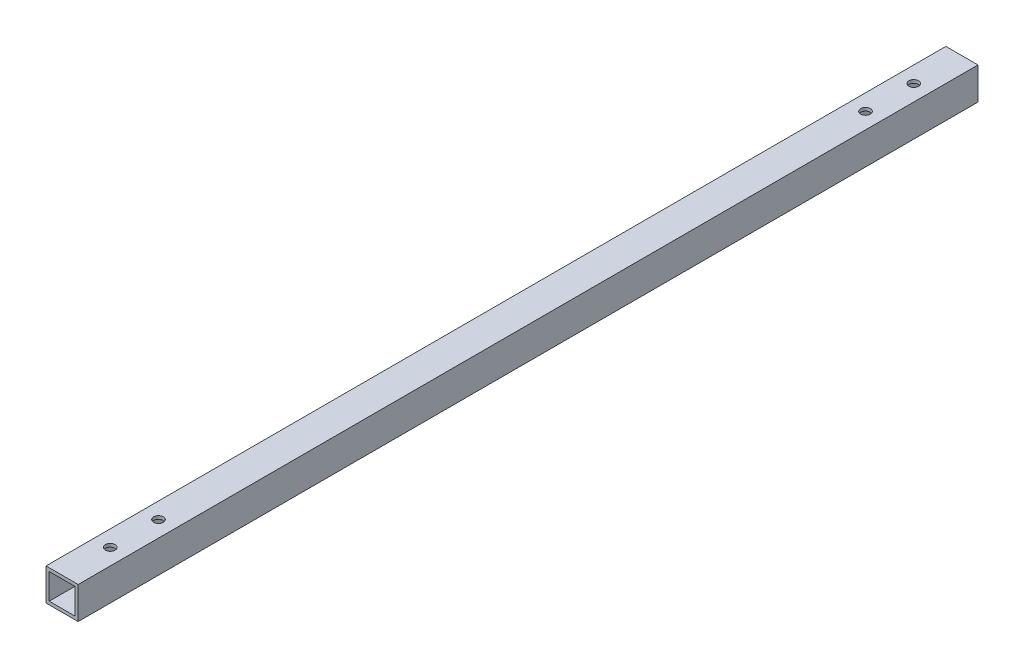
ISO-10303-21;
HEADER;
FILE_DESCRIPTION(('STEP AP214'),'2;1');
FILE_NAME('part.step','',(''),(''),'','','');
FILE_SCHEMA(('AUTOMOTIVE_DESIGN { 1 0 10303 214 1 1 1 1 }'));
ENDSEC;
DATA;
#1=APPLICATION_CONTEXT('core data for automotive mechanical design processes');
#2=APPLICATION_PROTOCOL_DEFINITION('international standard','automotive_design',2000,#1);
#3=PRODUCT_CONTEXT('',#1,'mechanical');
#4=PRODUCT('Part','Part','',(#3));
#5=PRODUCT_RELATED_PRODUCT_CATEGORY('part','',(#4));
#6=PRODUCT_DEFINITION_FORMATION('','',#4);
#7=PRODUCT_DEFINITION_CONTEXT('part definition',#1,'design');
#8=PRODUCT_DEFINITION('design','',#6,#7);
#9=PRODUCT_DEFINITION_SHAPE('','',#8);
#10=(LENGTH_UNIT() NAMED_UNIT(*) SI_UNIT(.MILLI.,.METRE.));
#11=(NAMED_UNIT(*) PLANE_ANGLE_UNIT() SI_UNIT($,.RADIAN.));
#12=(NAMED_UNIT(*) SI_UNIT($,.STERADIAN.) SOLID_ANGLE_UNIT());
#13=UNCERTAINTY_MEASURE_WITH_UNIT(LENGTH_MEASURE(1.E-05),#10,'distance_accuracy_value','');
#14=(GEOMETRIC_REPRESENTATION_CONTEXT(3) GLOBAL_UNCERTAINTY_ASSIGNED_CONTEXT((#13)) GLOBAL_UNIT_ASSIGNED_CONTEXT((#10,
#11,#12)) REPRESENTATION_CONTEXT('',''));
#15=CARTESIAN_POINT('',(0.,0.,0.));
#16=DIRECTION('',(0.,0.,1.));
#17=DIRECTION('',(1.,0.,0.));
#18=AXIS2_PLACEMENT_3D('',#15,#16,#17);
#19=CARTESIAN_POINT('',(0.,0.,280.));
#20=DIRECTION('',(0.,0.,1.));
#21=DIRECTION('',(1.,0.,0.));
#22=AXIS2_PLACEMENT_3D('',#19,#20,#21);
#23=PLANE('',#22);
#24=DIRECTION('',(0.,1.,0.));
#25=VECTOR('',#24,1.);
#26=CARTESIAN_POINT('',(5.,5.,280.));
#27=LINE('',#26,#25);
#28=CARTESIAN_POINT('',(5.,-5.,280.));
#29=VERTEX_POINT('',#28);
#30=CARTESIAN_POINT('',(5.,5.,280.));
#31=VERTEX_POINT('',#30);
#32=EDGE_CURVE('E157',#29,#31,#27,.T.);
#33=ORIENTED_EDGE('',*,*,#32,.T.);
#34=DIRECTION('',(-1.,0.,0.));
#35=VECTOR('',#34,1.);
#36=CARTESIAN_POINT('',(-5.,5.,280.));
#37=LINE('',#36,#35);
#38=CARTESIAN_POINT('',(-5.,5.,280.));
#39=VERTEX_POINT('',#38);
#40=EDGE_CURVE('E161',#31,#39,#37,.T.);
#41=ORIENTED_EDGE('',*,*,#40,.T.);
#42=DIRECTION('',(0.,-1.,0.));
#43=VECTOR('',#42,1.);
#44=CARTESIAN_POINT('',(-5.,5.,280.));
#45=LINE('',#44,#43);
#46=CARTESIAN_POINT('',(-5.,-5.,280.));
#47=VERTEX_POINT('',#46);
#48=EDGE_CURVE('E165',#39,#47,#45,.T.);
#49=ORIENTED_EDGE('',*,*,#48,.T.);
#50=DIRECTION('',(1.,0.,0.));
#51=VECTOR('',#50,1.);
#52=CARTESIAN_POINT('',(-5.,-5.,280.));
#53=LINE('',#52,#51);
#54=EDGE_CURVE('E168',#47,#29,#53,.T.);
#55=ORIENTED_EDGE('',*,*,#54,.T.);
#56=EDGE_LOOP('',(#33,#41,#49,#55));
#57=FACE_BOUND('',#56,.T.);
#58=DIRECTION('',(-1.,0.,0.));
#59=VECTOR('',#58,1.);
#60=CARTESIAN_POINT('',(-4.,4.,280.));
#61=LINE('',#60,#59);
#62=CARTESIAN_POINT('',(4.,4.,280.));
#63=VERTEX_POINT('',#62);
#64=CARTESIAN_POINT('',(-4.,4.,280.));
#65=VERTEX_POINT('',#64);
#66=EDGE_CURVE('E116',#63,#65,#61,.T.);
#67=ORIENTED_EDGE('',*,*,#66,.F.);
#68=DIRECTION('',(0.,1.,0.));
#69=VECTOR('',#68,1.);
#70=CARTESIAN_POINT('',(4.,4.,280.));
#71=LINE('',#70,#69);
#72=CARTESIAN_POINT('',(4.,-4.,280.));
#73=VERTEX_POINT('',#72);
#74=EDGE_CURVE('E107',#73,#63,#71,.T.);
#75=ORIENTED_EDGE('',*,*,#74,.F.);
#76=DIRECTION('',(1.,0.,0.));
#77=VECTOR('',#76,1.);
#78=CARTESIAN_POINT('',(-4.,-4.,280.));
#79=LINE('',#78,#77);
#80=CARTESIAN_POINT('',(-4.,-4.,280.));
#81=VERTEX_POINT('',#80);
#82=EDGE_CURVE('E133',#81,#73,#79,.T.);
#83=ORIENTED_EDGE('',*,*,#82,.F.);
#84=DIRECTION('',(0.,-1.,0.));
#85=VECTOR('',#84,1.);
#86=CARTESIAN_POINT('',(-4.,4.,280.));
#87=LINE('',#86,#85);
#88=EDGE_CURVE('E129',#65,#81,#87,.T.);
#89=ORIENTED_EDGE('',*,*,#88,.F.);
#90=EDGE_LOOP('',(#67,#75,#83,#89));
#91=FACE_BOUND('',#90,.T.);
#92=ADVANCED_FACE('F39',(#57,#91),#23,.T.);
#93=CARTESIAN_POINT('',(0.,0.,0.));
#94=DIRECTION('',(0.,0.,1.));
#95=DIRECTION('',(1.,0.,0.));
#96=AXIS2_PLACEMENT_3D('',#93,#94,#95);
#97=PLANE('',#96);
#98=DIRECTION('',(0.,1.,0.));
#99=VECTOR('',#98,1.);
#100=CARTESIAN_POINT('',(5.,5.,0.));
#101=LINE('',#100,#99);
#102=CARTESIAN_POINT('',(5.,-5.,0.));
#103=VERTEX_POINT('',#102);
#104=CARTESIAN_POINT('',(5.,5.,0.));
#105=VERTEX_POINT('',#104);
#106=EDGE_CURVE('E125',#103,#105,#101,.T.);
#107=ORIENTED_EDGE('',*,*,#106,.F.);
#108=DIRECTION('',(1.,0.,0.));
#109=VECTOR('',#108,1.);
#110=CARTESIAN_POINT('',(-5.,-5.,0.));
#111=LINE('',#110,#109);
#112=CARTESIAN_POINT('',(-5.,-5.,0.));
#113=VERTEX_POINT('',#112);
#114=EDGE_CURVE('E162',#113,#103,#111,.T.);
#115=ORIENTED_EDGE('',*,*,#114,.F.);
#116=DIRECTION('',(0.,-1.,0.));
#117=VECTOR('',#116,1.);
#118=CARTESIAN_POINT('',(-5.,5.,0.));
#119=LINE('',#118,#117);
#120=CARTESIAN_POINT('',(-5.,5.,0.));
#121=VERTEX_POINT('',#120);
#122=EDGE_CURVE('E178',#121,#113,#119,.T.);
#123=ORIENTED_EDGE('',*,*,#122,.F.);
#124=DIRECTION('',(-1.,0.,0.));
#125=VECTOR('',#124,1.);
#126=CARTESIAN_POINT('',(-5.,5.,0.));
#127=LINE('',#126,#125);
#128=EDGE_CURVE('E175',#105,#121,#127,.T.);
#129=ORIENTED_EDGE('',*,*,#128,.F.);
#130=EDGE_LOOP('',(#107,#115,#123,#129));
#131=FACE_BOUND('',#130,.T.);
#132=DIRECTION('',(0.,1.,0.));
#133=VECTOR('',#132,1.);
#134=CARTESIAN_POINT('',(4.,4.,0.));
#135=LINE('',#134,#133);
#136=CARTESIAN_POINT('',(4.,-4.,0.));
#137=VERTEX_POINT('',#136);
#138=CARTESIAN_POINT('',(4.,4.,0.));
#139=VERTEX_POINT('',#138);
#140=EDGE_CURVE('E65',#137,#139,#135,.T.);
#141=ORIENTED_EDGE('',*,*,#140,.T.);
#142=DIRECTION('',(-1.,0.,0.));
#143=VECTOR('',#142,1.);
#144=CARTESIAN_POINT('',(-4.,4.,0.));
#145=LINE('',#144,#143);
#146=CARTESIAN_POINT('',(-4.,4.,0.));
#147=VERTEX_POINT('',#146);
#148=EDGE_CURVE('E123',#139,#147,#145,.T.);
#149=ORIENTED_EDGE('',*,*,#148,.T.);
#150=DIRECTION('',(0.,-1.,0.));
#151=VECTOR('',#150,1.);
#152=CARTESIAN_POINT('',(-4.,4.,0.));
#153=LINE('',#152,#151);
#154=CARTESIAN_POINT('',(-4.,-4.,0.));
#155=VERTEX_POINT('',#154);
#156=EDGE_CURVE('E144',#147,#155,#153,.T.);
#157=ORIENTED_EDGE('',*,*,#156,.T.);
#158=DIRECTION('',(1.,0.,0.));
#159=VECTOR('',#158,1.);
#160=CARTESIAN_POINT('',(-4.,-4.,0.));
#161=LINE('',#160,#159);
#162=EDGE_CURVE('E117',#155,#137,#161,.T.);
#163=ORIENTED_EDGE('',*,*,#162,.T.);
#164=EDGE_LOOP('',(#141,#149,#157,#163));
#165=FACE_BOUND('',#164,.T.);
#166=ADVANCED_FACE('F260',(#131,#165),#97,.F.);
#167=CARTESIAN_POINT('',(5.,5.,280.));
#168=DIRECTION('',(-1.,0.,0.));
#169=DIRECTION('',(0.,-1.,0.));
#170=AXIS2_PLACEMENT_3D('',#167,#168,#169);
#171=PLANE('',#170);
#172=ORIENTED_EDGE('',*,*,#106,.T.);
#173=DIRECTION('',(0.,0.,-1.));
#174=VECTOR('',#173,1.);
#175=CARTESIAN_POINT('',(5.,5.,280.));
#176=LINE('',#175,#174);
#177=EDGE_CURVE('E11',#31,#105,#176,.T.);
#178=ORIENTED_EDGE('',*,*,#177,.F.);
#179=ORIENTED_EDGE('',*,*,#32,.F.);
#180=DIRECTION('',(0.,0.,-1.));
#181=VECTOR('',#180,1.);
#182=CARTESIAN_POINT('',(5.,-5.,280.));
#183=LINE('',#182,#181);
#184=EDGE_CURVE('E171',#29,#103,#183,.T.);
#185=ORIENTED_EDGE('',*,*,#184,.T.);
#186=EDGE_LOOP('',(#172,#178,#179,#185));
#187=FACE_BOUND('',#186,.T.);
#188=ADVANCED_FACE('F41',(#187),#171,.F.);
#189=CARTESIAN_POINT('',(-5.,5.,280.));
#190=DIRECTION('',(0.,-1.,0.));
#191=DIRECTION('',(1.,0.,0.));
#192=AXIS2_PLACEMENT_3D('',#189,#190,#191);
#193=PLANE('',#192);
#194=CARTESIAN_POINT('',(0.,5.,15.));
#195=DIRECTION('',(0.,1.,0.));
#196=DIRECTION('',(-1.,0.,0.));
#197=AXIS2_PLACEMENT_3D('',#194,#195,#196);
#198=CIRCLE('',#197,1.5);
#199=CARTESIAN_POINT('',(-1.5,5.,15.));
#200=VERTEX_POINT('',#199);
#201=EDGE_CURVE('E198',#200,#200,#198,.T.);
#202=ORIENTED_EDGE('',*,*,#201,.F.);
#203=EDGE_LOOP('',(#202));
#204=FACE_BOUND('',#203,.T.);
#205=CARTESIAN_POINT('',(0.,5.,250.));
#206=DIRECTION('',(0.,1.,0.));
#207=DIRECTION('',(-1.,0.,0.));
#208=AXIS2_PLACEMENT_3D('',#205,#206,#207);
#209=CIRCLE('',#208,1.5);
#210=CARTESIAN_POINT('',(-1.5,5.,250.));
#211=VERTEX_POINT('',#210);
#212=EDGE_CURVE('E289',#211,#211,#209,.T.);
#213=ORIENTED_EDGE('',*,*,#212,.F.);
#214=EDGE_LOOP('',(#213));
#215=FACE_BOUND('',#214,.T.);
#216=CARTESIAN_POINT('',(0.,5.,265.));
#217=DIRECTION('',(0.,1.,0.));
#218=DIRECTION('',(-1.,0.,0.));
#219=AXIS2_PLACEMENT_3D('',#216,#217,#218);
#220=CIRCLE('',#219,1.5);
#221=CARTESIAN_POINT('',(-1.5,5.,265.));
#222=VERTEX_POINT('',#221);
#223=EDGE_CURVE('E293',#222,#222,#220,.T.);
#224=ORIENTED_EDGE('',*,*,#223,.F.);
#225=EDGE_LOOP('',(#224));
#226=FACE_BOUND('',#225,.T.);
#227=CARTESIAN_POINT('',(0.,5.,30.));
#228=DIRECTION('',(0.,1.,0.));
#229=DIRECTION('',(-1.,0.,0.));
#230=AXIS2_PLACEMENT_3D('',#227,#228,#229);
#231=CIRCLE('',#230,1.5);
#232=CARTESIAN_POINT('',(-1.5,5.,30.));
#233=VERTEX_POINT('',#232);
#234=EDGE_CURVE('E297',#233,#233,#231,.T.);
#235=ORIENTED_EDGE('',*,*,#234,.F.);
#236=EDGE_LOOP('',(#235));
#237=FACE_BOUND('',#236,.T.);
#238=ORIENTED_EDGE('',*,*,#128,.T.);
#239=DIRECTION('',(0.,0.,-1.));
#240=VECTOR('',#239,1.);
#241=CARTESIAN_POINT('',(-5.,5.,280.));
#242=LINE('',#241,#240);
#243=EDGE_CURVE('E49',#39,#121,#242,.T.);
#244=ORIENTED_EDGE('',*,*,#243,.F.);
#245=ORIENTED_EDGE('',*,*,#40,.F.);
#246=ORIENTED_EDGE('',*,*,#177,.T.);
#247=EDGE_LOOP('',(#238,#244,#245,#246));
#248=FACE_BOUND('',#247,.T.);
#249=ADVANCED_FACE('F275',(#204,#215,#226,#237,#248),#193,.F.);
#250=CARTESIAN_POINT('',(-5.,5.,280.));
#251=DIRECTION('',(1.,0.,0.));
#252=DIRECTION('',(0.,1.,0.));
#253=AXIS2_PLACEMENT_3D('',#250,#251,#252);
#254=PLANE('',#253);
#255=ORIENTED_EDGE('',*,*,#122,.T.);
#256=DIRECTION('',(0.,0.,-1.));
#257=VECTOR('',#256,1.);
#258=CARTESIAN_POINT('',(-5.,-5.,280.));
#259=LINE('',#258,#257);
#260=EDGE_CURVE('E186',#47,#113,#259,.T.);
#261=ORIENTED_EDGE('',*,*,#260,.F.);
#262=ORIENTED_EDGE('',*,*,#48,.F.);
#263=ORIENTED_EDGE('',*,*,#243,.T.);
#264=EDGE_LOOP('',(#255,#261,#262,#263));
#265=FACE_BOUND('',#264,.T.);
#266=ADVANCED_FACE('F273',(#265),#254,.F.);
#267=CARTESIAN_POINT('',(-5.,-5.,280.));
#268=DIRECTION('',(0.,1.,0.));
#269=DIRECTION('',(0.,0.,1.));
#270=AXIS2_PLACEMENT_3D('',#267,#268,#269);
#271=PLANE('',#270);
#272=CARTESIAN_POINT('',(0.,-5.,15.));
#273=DIRECTION('',(0.,1.,0.));
#274=DIRECTION('',(0.,0.,1.));
#275=AXIS2_PLACEMENT_3D('',#272,#273,#274);
#276=CIRCLE('',#275,1.5);
#277=CARTESIAN_POINT('',(0.,-5.,16.5));
#278=VERTEX_POINT('',#277);
#279=EDGE_CURVE('E141',#278,#278,#276,.T.);
#280=ORIENTED_EDGE('',*,*,#279,.T.);
#281=EDGE_LOOP('',(#280));
#282=FACE_BOUND('',#281,.T.);
#283=CARTESIAN_POINT('',(0.,-5.,250.));
#284=DIRECTION('',(0.,1.,0.));
#285=DIRECTION('',(0.,0.,1.));
#286=AXIS2_PLACEMENT_3D('',#283,#284,#285);
#287=CIRCLE('',#286,1.5);
#288=CARTESIAN_POINT('',(0.,-5.,251.5));
#289=VERTEX_POINT('',#288);
#290=EDGE_CURVE('E214',#289,#289,#287,.T.);
#291=ORIENTED_EDGE('',*,*,#290,.T.);
#292=EDGE_LOOP('',(#291));
#293=FACE_BOUND('',#292,.T.);
#294=CARTESIAN_POINT('',(0.,-5.,265.));
#295=DIRECTION('',(0.,1.,0.));
#296=DIRECTION('',(0.,0.,1.));
#297=AXIS2_PLACEMENT_3D('',#294,#295,#296);
#298=CIRCLE('',#297,1.5);
#299=CARTESIAN_POINT('',(0.,-5.,266.5));
#300=VERTEX_POINT('',#299);
#301=EDGE_CURVE('E208',#300,#300,#298,.T.);
#302=ORIENTED_EDGE('',*,*,#301,.T.);
#303=EDGE_LOOP('',(#302));
#304=FACE_BOUND('',#303,.T.);
#305=CARTESIAN_POINT('',(0.,-5.,30.));
#306=DIRECTION('',(0.,1.,0.));
#307=DIRECTION('',(0.,0.,1.));
#308=AXIS2_PLACEMENT_3D('',#305,#306,#307);
#309=CIRCLE('',#308,1.5);
#310=CARTESIAN_POINT('',(0.,-5.,31.5));
#311=VERTEX_POINT('',#310);
#312=EDGE_CURVE('E203',#311,#311,#309,.T.);
#313=ORIENTED_EDGE('',*,*,#312,.T.);
#314=EDGE_LOOP('',(#313));
#315=FACE_BOUND('',#314,.T.);
#316=ORIENTED_EDGE('',*,*,#114,.T.);
#317=ORIENTED_EDGE('',*,*,#184,.F.);
#318=ORIENTED_EDGE('',*,*,#54,.F.);
#319=ORIENTED_EDGE('',*,*,#260,.T.);
#320=EDGE_LOOP('',(#316,#317,#318,#319));
#321=FACE_BOUND('',#320,.T.);
#322=ADVANCED_FACE('F235',(#282,#293,#304,#315,#321),#271,.F.);
#323=CARTESIAN_POINT('',(4.,4.,280.));
#324=DIRECTION('',(-1.,0.,0.));
#325=DIRECTION('',(0.,-1.,0.));
#326=AXIS2_PLACEMENT_3D('',#323,#324,#325);
#327=PLANE('',#326);
#328=ORIENTED_EDGE('',*,*,#140,.F.);
#329=DIRECTION('',(0.,0.,-1.));
#330=VECTOR('',#329,1.);
#331=CARTESIAN_POINT('',(4.,-4.,280.));
#332=LINE('',#331,#330);
#333=EDGE_CURVE('E111',#73,#137,#332,.T.);
#334=ORIENTED_EDGE('',*,*,#333,.F.);
#335=ORIENTED_EDGE('',*,*,#74,.T.);
#336=DIRECTION('',(0.,0.,-1.));
#337=VECTOR('',#336,1.);
#338=CARTESIAN_POINT('',(4.,4.,280.));
#339=LINE('',#338,#337);
#340=EDGE_CURVE('E110',#63,#139,#339,.T.);
#341=ORIENTED_EDGE('',*,*,#340,.T.);
#342=EDGE_LOOP('',(#328,#334,#335,#341));
#343=FACE_BOUND('',#342,.T.);
#344=ADVANCED_FACE('F109',(#343),#327,.T.);
#345=CARTESIAN_POINT('',(-4.,4.,280.));
#346=DIRECTION('',(0.,-1.,0.));
#347=DIRECTION('',(0.,0.,-1.));
#348=AXIS2_PLACEMENT_3D('',#345,#346,#347);
#349=PLANE('',#348);
#350=CARTESIAN_POINT('',(0.,4.,15.));
#351=DIRECTION('',(0.,-1.,0.));
#352=DIRECTION('',(0.,0.,-1.));
#353=AXIS2_PLACEMENT_3D('',#350,#351,#352);
#354=CIRCLE('',#353,1.5);
#355=CARTESIAN_POINT('',(0.,4.,13.5));
#356=VERTEX_POINT('',#355);
#357=EDGE_CURVE('E228',#356,#356,#354,.T.);
#358=ORIENTED_EDGE('',*,*,#357,.F.);
#359=EDGE_LOOP('',(#358));
#360=FACE_BOUND('',#359,.T.);
#361=CARTESIAN_POINT('',(0.,4.,250.));
#362=DIRECTION('',(0.,-1.,0.));
#363=DIRECTION('',(0.,0.,-1.));
#364=AXIS2_PLACEMENT_3D('',#361,#362,#363);
#365=CIRCLE('',#364,1.5);
#366=CARTESIAN_POINT('',(0.,4.,248.5));
#367=VERTEX_POINT('',#366);
#368=EDGE_CURVE('E207',#367,#367,#365,.T.);
#369=ORIENTED_EDGE('',*,*,#368,.F.);
#370=EDGE_LOOP('',(#369));
#371=FACE_BOUND('',#370,.T.);
#372=CARTESIAN_POINT('',(0.,4.,265.));
#373=DIRECTION('',(0.,-1.,0.));
#374=DIRECTION('',(0.,0.,-1.));
#375=AXIS2_PLACEMENT_3D('',#372,#373,#374);
#376=CIRCLE('',#375,1.5);
#377=CARTESIAN_POINT('',(0.,4.,263.5));
#378=VERTEX_POINT('',#377);
#379=EDGE_CURVE('E202',#378,#378,#376,.T.);
#380=ORIENTED_EDGE('',*,*,#379,.F.);
#381=EDGE_LOOP('',(#380));
#382=FACE_BOUND('',#381,.T.);
#383=CARTESIAN_POINT('',(0.,4.,30.));
#384=DIRECTION('',(0.,-1.,0.));
#385=DIRECTION('',(0.,0.,-1.));
#386=AXIS2_PLACEMENT_3D('',#383,#384,#385);
#387=CIRCLE('',#386,1.5);
#388=CARTESIAN_POINT('',(0.,4.,28.5));
#389=VERTEX_POINT('',#388);
#390=EDGE_CURVE('E197',#389,#389,#387,.T.);
#391=ORIENTED_EDGE('',*,*,#390,.F.);
#392=EDGE_LOOP('',(#391));
#393=FACE_BOUND('',#392,.T.);
#394=ORIENTED_EDGE('',*,*,#148,.F.);
#395=ORIENTED_EDGE('',*,*,#340,.F.);
#396=ORIENTED_EDGE('',*,*,#66,.T.);
#397=DIRECTION('',(0.,0.,-1.));
#398=VECTOR('',#397,1.);
#399=CARTESIAN_POINT('',(-4.,4.,280.));
#400=LINE('',#399,#398);
#401=EDGE_CURVE('E126',#65,#147,#400,.T.);
#402=ORIENTED_EDGE('',*,*,#401,.T.);
#403=EDGE_LOOP('',(#394,#395,#396,#402));
#404=FACE_BOUND('',#403,.T.);
#405=ADVANCED_FACE('F120',(#360,#371,#382,#393,#404),#349,.T.);
#406=CARTESIAN_POINT('',(-4.,4.,280.));
#407=DIRECTION('',(1.,0.,0.));
#408=DIRECTION('',(0.,1.,0.));
#409=AXIS2_PLACEMENT_3D('',#406,#407,#408);
#410=PLANE('',#409);
#411=ORIENTED_EDGE('',*,*,#156,.F.);
#412=ORIENTED_EDGE('',*,*,#401,.F.);
#413=ORIENTED_EDGE('',*,*,#88,.T.);
#414=DIRECTION('',(0.,0.,-1.));
#415=VECTOR('',#414,1.);
#416=CARTESIAN_POINT('',(-4.,-4.,280.));
#417=LINE('',#416,#415);
#418=EDGE_CURVE('E57',#81,#155,#417,.T.);
#419=ORIENTED_EDGE('',*,*,#418,.T.);
#420=EDGE_LOOP('',(#411,#412,#413,#419));
#421=FACE_BOUND('',#420,.T.);
#422=ADVANCED_FACE('F313',(#421),#410,.T.);
#423=CARTESIAN_POINT('',(-4.,-4.,280.));
#424=DIRECTION('',(0.,1.,0.));
#425=DIRECTION('',(0.,0.,1.));
#426=AXIS2_PLACEMENT_3D('',#423,#424,#425);
#427=PLANE('',#426);
#428=CARTESIAN_POINT('',(0.,-4.,15.));
#429=DIRECTION('',(0.,1.,0.));
#430=DIRECTION('',(0.,0.,1.));
#431=AXIS2_PLACEMENT_3D('',#428,#429,#430);
#432=CIRCLE('',#431,1.5);
#433=CARTESIAN_POINT('',(0.,-4.,16.5));
#434=VERTEX_POINT('',#433);
#435=EDGE_CURVE('E43',#434,#434,#432,.T.);
#436=ORIENTED_EDGE('',*,*,#435,.F.);
#437=EDGE_LOOP('',(#436));
#438=FACE_BOUND('',#437,.T.);
#439=CARTESIAN_POINT('',(0.,-4.,250.));
#440=DIRECTION('',(0.,1.,0.));
#441=DIRECTION('',(0.,0.,1.));
#442=AXIS2_PLACEMENT_3D('',#439,#440,#441);
#443=CIRCLE('',#442,1.5);
#444=CARTESIAN_POINT('',(0.,-4.,251.5));
#445=VERTEX_POINT('',#444);
#446=EDGE_CURVE('E204',#445,#445,#443,.T.);
#447=ORIENTED_EDGE('',*,*,#446,.F.);
#448=EDGE_LOOP('',(#447));
#449=FACE_BOUND('',#448,.T.);
#450=CARTESIAN_POINT('',(0.,-4.,265.));
#451=DIRECTION('',(0.,1.,0.));
#452=DIRECTION('',(0.,0.,1.));
#453=AXIS2_PLACEMENT_3D('',#450,#451,#452);
#454=CIRCLE('',#453,1.5);
#455=CARTESIAN_POINT('',(0.,-4.,266.5));
#456=VERTEX_POINT('',#455);
#457=EDGE_CURVE('E199',#456,#456,#454,.T.);
#458=ORIENTED_EDGE('',*,*,#457,.F.);
#459=EDGE_LOOP('',(#458));
#460=FACE_BOUND('',#459,.T.);
#461=CARTESIAN_POINT('',(0.,-4.,30.));
#462=DIRECTION('',(0.,1.,0.));
#463=DIRECTION('',(0.,0.,1.));
#464=AXIS2_PLACEMENT_3D('',#461,#462,#463);
#465=CIRCLE('',#464,1.5);
#466=CARTESIAN_POINT('',(0.,-4.,31.5));
#467=VERTEX_POINT('',#466);
#468=EDGE_CURVE('E193',#467,#467,#465,.T.);
#469=ORIENTED_EDGE('',*,*,#468,.F.);
#470=EDGE_LOOP('',(#469));
#471=FACE_BOUND('',#470,.T.);
#472=ORIENTED_EDGE('',*,*,#162,.F.);
#473=ORIENTED_EDGE('',*,*,#418,.F.);
#474=ORIENTED_EDGE('',*,*,#82,.T.);
#475=ORIENTED_EDGE('',*,*,#333,.T.);
#476=EDGE_LOOP('',(#472,#473,#474,#475));
#477=FACE_BOUND('',#476,.T.);
#478=ADVANCED_FACE('F311',(#438,#449,#460,#471,#477),#427,.T.);
#479=CARTESIAN_POINT('',(0.,-23.,30.));
#480=DIRECTION('',(0.,1.,0.));
#481=DIRECTION('',(-1.,0.,0.));
#482=AXIS2_PLACEMENT_3D('',#479,#480,#481);
#483=CYLINDRICAL_SURFACE('',#482,1.5);
#484=ORIENTED_EDGE('',*,*,#468,.T.);
#485=EDGE_LOOP('',(#484));
#486=FACE_BOUND('',#485,.T.);
#487=ORIENTED_EDGE('',*,*,#312,.F.);
#488=EDGE_LOOP('',(#487));
#489=FACE_BOUND('',#488,.T.);
#490=ADVANCED_FACE('F252',(#486,#489),#483,.F.);
#491=CARTESIAN_POINT('',(0.,-23.,265.));
#492=DIRECTION('',(0.,1.,0.));
#493=DIRECTION('',(-1.,0.,0.));
#494=AXIS2_PLACEMENT_3D('',#491,#492,#493);
#495=CYLINDRICAL_SURFACE('',#494,1.5);
#496=ORIENTED_EDGE('',*,*,#457,.T.);
#497=EDGE_LOOP('',(#496));
#498=FACE_BOUND('',#497,.T.);
#499=ORIENTED_EDGE('',*,*,#301,.F.);
#500=EDGE_LOOP('',(#499));
#501=FACE_BOUND('',#500,.T.);
#502=ADVANCED_FACE('F253',(#498,#501),#495,.F.);
#503=CARTESIAN_POINT('',(0.,-23.,250.));
#504=DIRECTION('',(0.,1.,0.));
#505=DIRECTION('',(-1.,0.,0.));
#506=AXIS2_PLACEMENT_3D('',#503,#504,#505);
#507=CYLINDRICAL_SURFACE('',#506,1.5);
#508=ORIENTED_EDGE('',*,*,#446,.T.);
#509=EDGE_LOOP('',(#508));
#510=FACE_BOUND('',#509,.T.);
#511=ORIENTED_EDGE('',*,*,#290,.F.);
#512=EDGE_LOOP('',(#511));
#513=FACE_BOUND('',#512,.T.);
#514=ADVANCED_FACE('F241',(#510,#513),#507,.F.);
#515=CARTESIAN_POINT('',(0.,-23.,15.));
#516=DIRECTION('',(0.,1.,0.));
#517=DIRECTION('',(-1.,0.,0.));
#518=AXIS2_PLACEMENT_3D('',#515,#516,#517);
#519=CYLINDRICAL_SURFACE('',#518,1.5);
#520=ORIENTED_EDGE('',*,*,#435,.T.);
#521=EDGE_LOOP('',(#520));
#522=FACE_BOUND('',#521,.T.);
#523=ORIENTED_EDGE('',*,*,#279,.F.);
#524=EDGE_LOOP('',(#523));
#525=FACE_BOUND('',#524,.T.);
#526=ADVANCED_FACE('F238',(#522,#525),#519,.F.);
#527=ORIENTED_EDGE('',*,*,#390,.T.);
#528=EDGE_LOOP('',(#527));
#529=FACE_BOUND('',#528,.T.);
#530=ORIENTED_EDGE('',*,*,#234,.T.);
#531=EDGE_LOOP('',(#530));
#532=FACE_BOUND('',#531,.T.);
#533=ADVANCED_FACE('F240',(#529,#532),#483,.F.);
#534=ORIENTED_EDGE('',*,*,#379,.T.);
#535=EDGE_LOOP('',(#534));
#536=FACE_BOUND('',#535,.T.);
#537=ORIENTED_EDGE('',*,*,#223,.T.);
#538=EDGE_LOOP('',(#537));
#539=FACE_BOUND('',#538,.T.);
#540=ADVANCED_FACE('F249',(#536,#539),#495,.F.);
#541=ORIENTED_EDGE('',*,*,#368,.T.);
#542=EDGE_LOOP('',(#541));
#543=FACE_BOUND('',#542,.T.);
#544=ORIENTED_EDGE('',*,*,#212,.T.);
#545=EDGE_LOOP('',(#544));
#546=FACE_BOUND('',#545,.T.);
#547=ADVANCED_FACE('F255',(#543,#546),#507,.F.);
#548=ORIENTED_EDGE('',*,*,#357,.T.);
#549=EDGE_LOOP('',(#548));
#550=FACE_BOUND('',#549,.T.);
#551=ORIENTED_EDGE('',*,*,#201,.T.);
#552=EDGE_LOOP('',(#551));
#553=FACE_BOUND('',#552,.T.);
#554=ADVANCED_FACE('F244',(#550,#553),#519,.F.);
#555=CLOSED_SHELL('',(#92,#166,#188,#249,#266,#322,#344,#405,#422,#478,#490,#502,#514,#526,#533,
#540,#547,#554));
#556=MANIFOLD_SOLID_BREP('B2',#555);
#557=ADVANCED_BREP_SHAPE_REPRESENTATION('',(#18,#556),#14);
#558=SHAPE_DEFINITION_REPRESENTATION(#9,#557);
ENDSEC;
END-ISO-10303-21;
